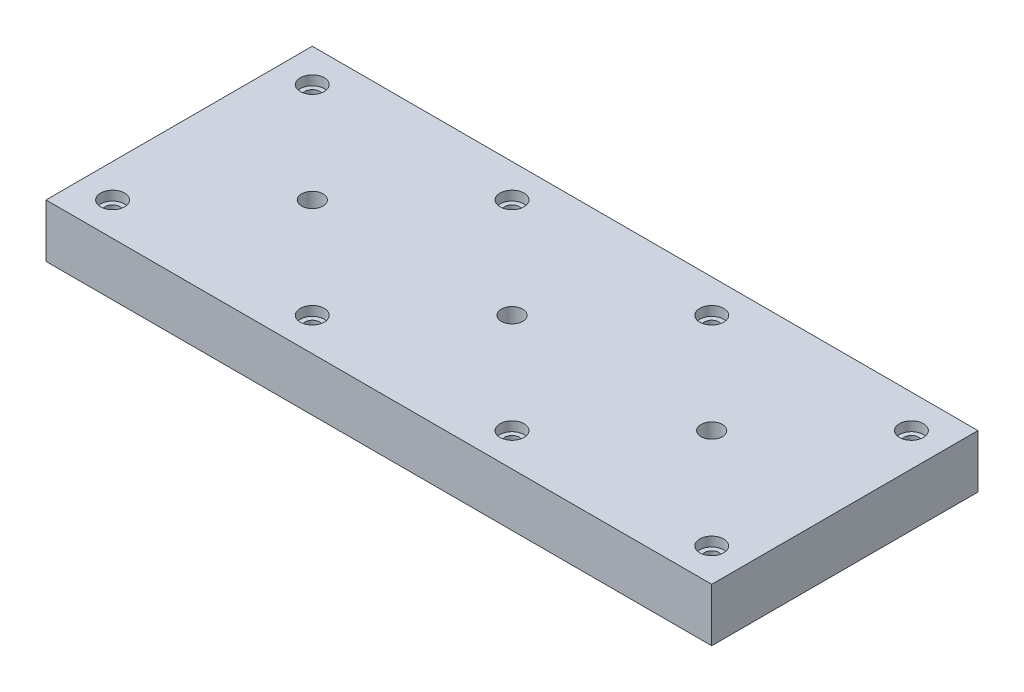
ISO-10303-21;
HEADER;
FILE_DESCRIPTION(('STEP AP214'),'2;1');
FILE_NAME('part.step','',(''),(''),'','','');
FILE_SCHEMA(('AUTOMOTIVE_DESIGN { 1 0 10303 214 1 1 1 1 }'));
ENDSEC;
DATA;
#1=APPLICATION_CONTEXT('core data for automotive mechanical design processes');
#2=APPLICATION_PROTOCOL_DEFINITION('international standard','automotive_design',2000,#1);
#3=PRODUCT_CONTEXT('',#1,'mechanical');
#4=PRODUCT('Part','Part','',(#3));
#5=PRODUCT_RELATED_PRODUCT_CATEGORY('part','',(#4));
#6=PRODUCT_DEFINITION_FORMATION('','',#4);
#7=PRODUCT_DEFINITION_CONTEXT('part definition',#1,'design');
#8=PRODUCT_DEFINITION('design','',#6,#7);
#9=PRODUCT_DEFINITION_SHAPE('','',#8);
#10=(LENGTH_UNIT() NAMED_UNIT(*) SI_UNIT(.MILLI.,.METRE.));
#11=(NAMED_UNIT(*) PLANE_ANGLE_UNIT() SI_UNIT($,.RADIAN.));
#12=(NAMED_UNIT(*) SI_UNIT($,.STERADIAN.) SOLID_ANGLE_UNIT());
#13=UNCERTAINTY_MEASURE_WITH_UNIT(LENGTH_MEASURE(1.E-05),#10,'distance_accuracy_value','');
#14=(GEOMETRIC_REPRESENTATION_CONTEXT(3) GLOBAL_UNCERTAINTY_ASSIGNED_CONTEXT((#13)) GLOBAL_UNIT_ASSIGNED_CONTEXT((#10,
#11,#12)) REPRESENTATION_CONTEXT('',''));
#15=CARTESIAN_POINT('',(0.,0.,0.));
#16=DIRECTION('',(0.,0.,1.));
#17=DIRECTION('',(1.,0.,0.));
#18=AXIS2_PLACEMENT_3D('',#15,#16,#17);
#19=CARTESIAN_POINT('',(0.,40.,0.));
#20=DIRECTION('',(0.,-1.,0.));
#21=DIRECTION('',(0.,0.,-1.));
#22=AXIS2_PLACEMENT_3D('',#19,#20,#21);
#23=PLANE('',#22);
#24=CARTESIAN_POINT('',(150.,40.,0.));
#25=DIRECTION('',(0.,1.,0.));
#26=DIRECTION('',(0.,0.,1.));
#27=AXIS2_PLACEMENT_3D('',#24,#25,#26);
#28=CIRCLE('',#27,8.00000000000001);
#29=CARTESIAN_POINT('',(150.,40.,8.00000000000001));
#30=VERTEX_POINT('',#29);
#31=EDGE_CURVE('E213',#30,#30,#28,.T.);
#32=ORIENTED_EDGE('',*,*,#31,.F.);
#33=EDGE_LOOP('',(#32));
#34=FACE_BOUND('',#33,.T.);
#35=CARTESIAN_POINT('',(-225.,40.,-75.));
#36=DIRECTION('',(0.,1.,0.));
#37=DIRECTION('',(0.,0.,1.));
#38=AXIS2_PLACEMENT_3D('',#35,#36,#37);
#39=CIRCLE('',#38,9.00000000000001);
#40=CARTESIAN_POINT('',(-225.,40.,-66.));
#41=VERTEX_POINT('',#40);
#42=EDGE_CURVE('E207',#41,#41,#39,.T.);
#43=ORIENTED_EDGE('',*,*,#42,.F.);
#44=EDGE_LOOP('',(#43));
#45=FACE_BOUND('',#44,.T.);
#46=CARTESIAN_POINT('',(-74.9999999999998,40.,-75.));
#47=DIRECTION('',(0.,1.,0.));
#48=DIRECTION('',(0.,0.,1.));
#49=AXIS2_PLACEMENT_3D('',#46,#47,#48);
#50=CIRCLE('',#49,8.99999999999999);
#51=CARTESIAN_POINT('',(-74.9999999999998,40.,-66.));
#52=VERTEX_POINT('',#51);
#53=EDGE_CURVE('E195',#52,#52,#50,.T.);
#54=ORIENTED_EDGE('',*,*,#53,.F.);
#55=EDGE_LOOP('',(#54));
#56=FACE_BOUND('',#55,.T.);
#57=CARTESIAN_POINT('',(75.0000000000002,40.,-75.));
#58=DIRECTION('',(0.,1.,0.));
#59=DIRECTION('',(0.,0.,1.));
#60=AXIS2_PLACEMENT_3D('',#57,#58,#59);
#61=CIRCLE('',#60,8.99999999999999);
#62=CARTESIAN_POINT('',(75.0000000000002,40.,-66.));
#63=VERTEX_POINT('',#62);
#64=EDGE_CURVE('E183',#63,#63,#61,.T.);
#65=ORIENTED_EDGE('',*,*,#64,.F.);
#66=EDGE_LOOP('',(#65));
#67=FACE_BOUND('',#66,.T.);
#68=CARTESIAN_POINT('',(-74.9999999999961,40.,75.));
#69=DIRECTION('',(0.,1.,0.));
#70=DIRECTION('',(0.,0.,1.));
#71=AXIS2_PLACEMENT_3D('',#68,#69,#70);
#72=CIRCLE('',#71,8.99999999999999);
#73=CARTESIAN_POINT('',(-74.9999999999961,40.,84.));
#74=VERTEX_POINT('',#73);
#75=EDGE_CURVE('E171',#74,#74,#72,.T.);
#76=ORIENTED_EDGE('',*,*,#75,.F.);
#77=EDGE_LOOP('',(#76));
#78=FACE_BOUND('',#77,.T.);
#79=CARTESIAN_POINT('',(75.000000000004,40.,75.));
#80=DIRECTION('',(0.,1.,0.));
#81=DIRECTION('',(0.,0.,1.));
#82=AXIS2_PLACEMENT_3D('',#79,#80,#81);
#83=CIRCLE('',#82,8.99999999999999);
#84=CARTESIAN_POINT('',(75.000000000004,40.,84.));
#85=VERTEX_POINT('',#84);
#86=EDGE_CURVE('E159',#85,#85,#83,.T.);
#87=ORIENTED_EDGE('',*,*,#86,.F.);
#88=EDGE_LOOP('',(#87));
#89=FACE_BOUND('',#88,.T.);
#90=CARTESIAN_POINT('',(-224.999999999998,40.,75.));
#91=DIRECTION('',(0.,1.,0.));
#92=DIRECTION('',(0.,0.,1.));
#93=AXIS2_PLACEMENT_3D('',#90,#91,#92);
#94=CIRCLE('',#93,9.00000000000001);
#95=CARTESIAN_POINT('',(-224.999999999998,40.,84.));
#96=VERTEX_POINT('',#95);
#97=EDGE_CURVE('E147',#96,#96,#94,.T.);
#98=ORIENTED_EDGE('',*,*,#97,.F.);
#99=EDGE_LOOP('',(#98));
#100=FACE_BOUND('',#99,.T.);
#101=CARTESIAN_POINT('',(225.,40.,-75.));
#102=DIRECTION('',(0.,1.,0.));
#103=DIRECTION('',(0.,0.,1.));
#104=AXIS2_PLACEMENT_3D('',#101,#102,#103);
#105=CIRCLE('',#104,9.00000000000001);
#106=CARTESIAN_POINT('',(225.,40.,-66.));
#107=VERTEX_POINT('',#106);
#108=EDGE_CURVE('E135',#107,#107,#105,.T.);
#109=ORIENTED_EDGE('',*,*,#108,.F.);
#110=EDGE_LOOP('',(#109));
#111=FACE_BOUND('',#110,.T.);
#112=CARTESIAN_POINT('',(225.000000000004,40.,75.));
#113=DIRECTION('',(0.,1.,0.));
#114=DIRECTION('',(0.,0.,1.));
#115=AXIS2_PLACEMENT_3D('',#112,#113,#114);
#116=CIRCLE('',#115,9.00000000000001);
#117=CARTESIAN_POINT('',(225.000000000004,40.,84.));
#118=VERTEX_POINT('',#117);
#119=EDGE_CURVE('E123',#118,#118,#116,.T.);
#120=ORIENTED_EDGE('',*,*,#119,.F.);
#121=EDGE_LOOP('',(#120));
#122=FACE_BOUND('',#121,.T.);
#123=DIRECTION('',(0.,0.,-1.));
#124=VECTOR('',#123,1.);
#125=CARTESIAN_POINT('',(250.,40.,100.));
#126=LINE('',#125,#124);
#127=CARTESIAN_POINT('',(250.,40.,100.));
#128=VERTEX_POINT('',#127);
#129=CARTESIAN_POINT('',(250.,40.,-100.));
#130=VERTEX_POINT('',#129);
#131=EDGE_CURVE('E89',#128,#130,#126,.T.);
#132=ORIENTED_EDGE('',*,*,#131,.T.);
#133=DIRECTION('',(-1.,0.,0.));
#134=VECTOR('',#133,1.);
#135=CARTESIAN_POINT('',(-250.,40.,-100.));
#136=LINE('',#135,#134);
#137=CARTESIAN_POINT('',(-250.,40.,-100.));
#138=VERTEX_POINT('',#137);
#139=EDGE_CURVE('E84',#130,#138,#136,.T.);
#140=ORIENTED_EDGE('',*,*,#139,.T.);
#141=DIRECTION('',(0.,0.,1.));
#142=VECTOR('',#141,1.);
#143=CARTESIAN_POINT('',(-250.,40.,100.));
#144=LINE('',#143,#142);
#145=CARTESIAN_POINT('',(-250.,40.,100.));
#146=VERTEX_POINT('',#145);
#147=EDGE_CURVE('E87',#138,#146,#144,.T.);
#148=ORIENTED_EDGE('',*,*,#147,.T.);
#149=DIRECTION('',(1.,0.,0.));
#150=VECTOR('',#149,1.);
#151=CARTESIAN_POINT('',(-250.,40.,100.));
#152=LINE('',#151,#150);
#153=EDGE_CURVE('E54',#146,#128,#152,.T.);
#154=ORIENTED_EDGE('',*,*,#153,.T.);
#155=EDGE_LOOP('',(#132,#140,#148,#154));
#156=FACE_BOUND('',#155,.T.);
#157=CARTESIAN_POINT('',(2.22044604925031E-13,40.,0.));
#158=DIRECTION('',(0.,1.,0.));
#159=DIRECTION('',(0.,0.,1.));
#160=AXIS2_PLACEMENT_3D('',#157,#158,#159);
#161=CIRCLE('',#160,7.99999999999999);
#162=CARTESIAN_POINT('',(2.22044604925031E-13,40.,7.99999999999999));
#163=VERTEX_POINT('',#162);
#164=EDGE_CURVE('E219',#163,#163,#161,.T.);
#165=ORIENTED_EDGE('',*,*,#164,.F.);
#166=EDGE_LOOP('',(#165));
#167=FACE_BOUND('',#166,.T.);
#168=CARTESIAN_POINT('',(-150.,40.,0.));
#169=DIRECTION('',(0.,1.,0.));
#170=DIRECTION('',(0.,0.,1.));
#171=AXIS2_PLACEMENT_3D('',#168,#169,#170);
#172=CIRCLE('',#171,8.00000000000001);
#173=CARTESIAN_POINT('',(-150.,40.,8.00000000000001));
#174=VERTEX_POINT('',#173);
#175=EDGE_CURVE('E225',#174,#174,#172,.T.);
#176=ORIENTED_EDGE('',*,*,#175,.F.);
#177=EDGE_LOOP('',(#176));
#178=FACE_BOUND('',#177,.T.);
#179=ADVANCED_FACE('F37',(#34,#45,#56,#67,#78,#89,#100,#111,#122,#156,#167,#178),#23,.F.);
#180=CARTESIAN_POINT('',(250.,40.,100.));
#181=DIRECTION('',(-1.,0.,0.));
#182=DIRECTION('',(0.,0.,1.));
#183=AXIS2_PLACEMENT_3D('',#180,#181,#182);
#184=PLANE('',#183);
#185=DIRECTION('',(0.,0.,-1.));
#186=VECTOR('',#185,1.);
#187=CARTESIAN_POINT('',(250.,0.,100.));
#188=LINE('',#187,#186);
#189=CARTESIAN_POINT('',(250.,0.,100.));
#190=VERTEX_POINT('',#189);
#191=CARTESIAN_POINT('',(250.,0.,-100.));
#192=VERTEX_POINT('',#191);
#193=EDGE_CURVE('E101',#190,#192,#188,.T.);
#194=ORIENTED_EDGE('',*,*,#193,.T.);
#195=DIRECTION('',(0.,-1.,0.));
#196=VECTOR('',#195,1.);
#197=CARTESIAN_POINT('',(250.,40.,-100.));
#198=LINE('',#197,#196);
#199=EDGE_CURVE('E11',#130,#192,#198,.T.);
#200=ORIENTED_EDGE('',*,*,#199,.F.);
#201=ORIENTED_EDGE('',*,*,#131,.F.);
#202=DIRECTION('',(0.,-1.,0.));
#203=VECTOR('',#202,1.);
#204=CARTESIAN_POINT('',(250.,40.,100.));
#205=LINE('',#204,#203);
#206=EDGE_CURVE('E97',#128,#190,#205,.T.);
#207=ORIENTED_EDGE('',*,*,#206,.T.);
#208=EDGE_LOOP('',(#194,#200,#201,#207));
#209=FACE_BOUND('',#208,.T.);
#210=ADVANCED_FACE('F39',(#209),#184,.F.);
#211=CARTESIAN_POINT('',(-250.,40.,-100.));
#212=DIRECTION('',(0.,0.,1.));
#213=DIRECTION('',(1.,0.,0.));
#214=AXIS2_PLACEMENT_3D('',#211,#212,#213);
#215=PLANE('',#214);
#216=DIRECTION('',(-1.,0.,0.));
#217=VECTOR('',#216,1.);
#218=CARTESIAN_POINT('',(-250.,0.,-100.));
#219=LINE('',#218,#217);
#220=CARTESIAN_POINT('',(-250.,0.,-100.));
#221=VERTEX_POINT('',#220);
#222=EDGE_CURVE('E93',#192,#221,#219,.T.);
#223=ORIENTED_EDGE('',*,*,#222,.T.);
#224=DIRECTION('',(0.,-1.,0.));
#225=VECTOR('',#224,1.);
#226=CARTESIAN_POINT('',(-250.,40.,-100.));
#227=LINE('',#226,#225);
#228=EDGE_CURVE('E46',#138,#221,#227,.T.);
#229=ORIENTED_EDGE('',*,*,#228,.F.);
#230=ORIENTED_EDGE('',*,*,#139,.F.);
#231=ORIENTED_EDGE('',*,*,#199,.T.);
#232=EDGE_LOOP('',(#223,#229,#230,#231));
#233=FACE_BOUND('',#232,.T.);
#234=ADVANCED_FACE('F92',(#233),#215,.F.);
#235=CARTESIAN_POINT('',(-250.,40.,100.));
#236=DIRECTION('',(1.,0.,0.));
#237=DIRECTION('',(0.,0.,-1.));
#238=AXIS2_PLACEMENT_3D('',#235,#236,#237);
#239=PLANE('',#238);
#240=DIRECTION('',(0.,0.,1.));
#241=VECTOR('',#240,1.);
#242=CARTESIAN_POINT('',(-250.,0.,100.));
#243=LINE('',#242,#241);
#244=CARTESIAN_POINT('',(-250.,0.,100.));
#245=VERTEX_POINT('',#244);
#246=EDGE_CURVE('E71',#221,#245,#243,.T.);
#247=ORIENTED_EDGE('',*,*,#246,.T.);
#248=DIRECTION('',(0.,-1.,0.));
#249=VECTOR('',#248,1.);
#250=CARTESIAN_POINT('',(-250.,40.,100.));
#251=LINE('',#250,#249);
#252=EDGE_CURVE('E94',#146,#245,#251,.T.);
#253=ORIENTED_EDGE('',*,*,#252,.F.);
#254=ORIENTED_EDGE('',*,*,#147,.F.);
#255=ORIENTED_EDGE('',*,*,#228,.T.);
#256=EDGE_LOOP('',(#247,#253,#254,#255));
#257=FACE_BOUND('',#256,.T.);
#258=ADVANCED_FACE('F95',(#257),#239,.F.);
#259=CARTESIAN_POINT('',(-250.,40.,100.));
#260=DIRECTION('',(0.,0.,-1.));
#261=DIRECTION('',(-1.,0.,0.));
#262=AXIS2_PLACEMENT_3D('',#259,#260,#261);
#263=PLANE('',#262);
#264=DIRECTION('',(1.,0.,0.));
#265=VECTOR('',#264,1.);
#266=CARTESIAN_POINT('',(-250.,0.,100.));
#267=LINE('',#266,#265);
#268=EDGE_CURVE('E77',#245,#190,#267,.T.);
#269=ORIENTED_EDGE('',*,*,#268,.T.);
#270=ORIENTED_EDGE('',*,*,#206,.F.);
#271=ORIENTED_EDGE('',*,*,#153,.F.);
#272=ORIENTED_EDGE('',*,*,#252,.T.);
#273=EDGE_LOOP('',(#269,#270,#271,#272));
#274=FACE_BOUND('',#273,.T.);
#275=ADVANCED_FACE('F109',(#274),#263,.F.);
#276=CARTESIAN_POINT('',(0.,0.,0.));
#277=DIRECTION('',(0.,-1.,0.));
#278=DIRECTION('',(0.,0.,-1.));
#279=AXIS2_PLACEMENT_3D('',#276,#277,#278);
#280=PLANE('',#279);
#281=CARTESIAN_POINT('',(-150.,0.,0.));
#282=DIRECTION('',(0.,-1.,0.));
#283=DIRECTION('',(0.,0.,-1.));
#284=AXIS2_PLACEMENT_3D('',#281,#282,#283);
#285=CIRCLE('',#284,7.99999999999999);
#286=CARTESIAN_POINT('',(-150.,0.,-7.99999999999999));
#287=VERTEX_POINT('',#286);
#288=EDGE_CURVE('E222',#287,#287,#285,.T.);
#289=ORIENTED_EDGE('',*,*,#288,.F.);
#290=EDGE_LOOP('',(#289));
#291=FACE_BOUND('',#290,.T.);
#292=CARTESIAN_POINT('',(2.22044604925031E-13,0.,0.));
#293=DIRECTION('',(0.,-1.,0.));
#294=DIRECTION('',(0.,0.,-1.));
#295=AXIS2_PLACEMENT_3D('',#292,#293,#294);
#296=CIRCLE('',#295,7.99999999999999);
#297=CARTESIAN_POINT('',(2.22044604925031E-13,0.,-7.99999999999999));
#298=VERTEX_POINT('',#297);
#299=EDGE_CURVE('E216',#298,#298,#296,.T.);
#300=ORIENTED_EDGE('',*,*,#299,.F.);
#301=EDGE_LOOP('',(#300));
#302=FACE_BOUND('',#301,.T.);
#303=CARTESIAN_POINT('',(150.,0.,0.));
#304=DIRECTION('',(0.,-1.,0.));
#305=DIRECTION('',(0.,0.,-1.));
#306=AXIS2_PLACEMENT_3D('',#303,#304,#305);
#307=CIRCLE('',#306,7.99999999999999);
#308=CARTESIAN_POINT('',(150.,0.,-7.99999999999999));
#309=VERTEX_POINT('',#308);
#310=EDGE_CURVE('E210',#309,#309,#307,.T.);
#311=ORIENTED_EDGE('',*,*,#310,.F.);
#312=EDGE_LOOP('',(#311));
#313=FACE_BOUND('',#312,.T.);
#314=CARTESIAN_POINT('',(-225.,0.,-75.));
#315=DIRECTION('',(0.,-1.,0.));
#316=DIRECTION('',(0.,0.,-1.));
#317=AXIS2_PLACEMENT_3D('',#314,#315,#316);
#318=CIRCLE('',#317,5.49999999999999);
#319=CARTESIAN_POINT('',(-225.,0.,-80.5));
#320=VERTEX_POINT('',#319);
#321=EDGE_CURVE('E198',#320,#320,#318,.T.);
#322=ORIENTED_EDGE('',*,*,#321,.F.);
#323=EDGE_LOOP('',(#322));
#324=FACE_BOUND('',#323,.T.);
#325=CARTESIAN_POINT('',(-74.9999999999998,0.,-75.));
#326=DIRECTION('',(0.,-1.,0.));
#327=DIRECTION('',(0.,0.,-1.));
#328=AXIS2_PLACEMENT_3D('',#325,#326,#327);
#329=CIRCLE('',#328,5.5);
#330=CARTESIAN_POINT('',(-74.9999999999998,0.,-80.5));
#331=VERTEX_POINT('',#330);
#332=EDGE_CURVE('E186',#331,#331,#329,.T.);
#333=ORIENTED_EDGE('',*,*,#332,.F.);
#334=EDGE_LOOP('',(#333));
#335=FACE_BOUND('',#334,.T.);
#336=CARTESIAN_POINT('',(75.0000000000002,0.,-75.));
#337=DIRECTION('',(0.,-1.,0.));
#338=DIRECTION('',(0.,0.,-1.));
#339=AXIS2_PLACEMENT_3D('',#336,#337,#338);
#340=CIRCLE('',#339,5.5);
#341=CARTESIAN_POINT('',(75.0000000000002,0.,-80.5));
#342=VERTEX_POINT('',#341);
#343=EDGE_CURVE('E174',#342,#342,#340,.T.);
#344=ORIENTED_EDGE('',*,*,#343,.F.);
#345=EDGE_LOOP('',(#344));
#346=FACE_BOUND('',#345,.T.);
#347=CARTESIAN_POINT('',(-74.9999999999961,0.,75.));
#348=DIRECTION('',(0.,-1.,0.));
#349=DIRECTION('',(0.,0.,-1.));
#350=AXIS2_PLACEMENT_3D('',#347,#348,#349);
#351=CIRCLE('',#350,5.5);
#352=CARTESIAN_POINT('',(-74.9999999999961,0.,69.5));
#353=VERTEX_POINT('',#352);
#354=EDGE_CURVE('E162',#353,#353,#351,.T.);
#355=ORIENTED_EDGE('',*,*,#354,.F.);
#356=EDGE_LOOP('',(#355));
#357=FACE_BOUND('',#356,.T.);
#358=CARTESIAN_POINT('',(75.000000000004,0.,75.));
#359=DIRECTION('',(0.,-1.,0.));
#360=DIRECTION('',(0.,0.,-1.));
#361=AXIS2_PLACEMENT_3D('',#358,#359,#360);
#362=CIRCLE('',#361,5.5);
#363=CARTESIAN_POINT('',(75.000000000004,0.,69.5));
#364=VERTEX_POINT('',#363);
#365=EDGE_CURVE('E150',#364,#364,#362,.T.);
#366=ORIENTED_EDGE('',*,*,#365,.F.);
#367=EDGE_LOOP('',(#366));
#368=FACE_BOUND('',#367,.T.);
#369=CARTESIAN_POINT('',(-224.999999999998,0.,75.));
#370=DIRECTION('',(0.,-1.,0.));
#371=DIRECTION('',(0.,0.,-1.));
#372=AXIS2_PLACEMENT_3D('',#369,#370,#371);
#373=CIRCLE('',#372,5.49999999999999);
#374=CARTESIAN_POINT('',(-224.999999999998,0.,69.5));
#375=VERTEX_POINT('',#374);
#376=EDGE_CURVE('E138',#375,#375,#373,.T.);
#377=ORIENTED_EDGE('',*,*,#376,.F.);
#378=EDGE_LOOP('',(#377));
#379=FACE_BOUND('',#378,.T.);
#380=CARTESIAN_POINT('',(225.,0.,-75.));
#381=DIRECTION('',(0.,-1.,0.));
#382=DIRECTION('',(0.,0.,-1.));
#383=AXIS2_PLACEMENT_3D('',#380,#381,#382);
#384=CIRCLE('',#383,5.49999999999999);
#385=CARTESIAN_POINT('',(225.,0.,-80.5));
#386=VERTEX_POINT('',#385);
#387=EDGE_CURVE('E126',#386,#386,#384,.T.);
#388=ORIENTED_EDGE('',*,*,#387,.F.);
#389=EDGE_LOOP('',(#388));
#390=FACE_BOUND('',#389,.T.);
#391=CARTESIAN_POINT('',(225.000000000004,0.,75.));
#392=DIRECTION('',(0.,-1.,0.));
#393=DIRECTION('',(0.,0.,-1.));
#394=AXIS2_PLACEMENT_3D('',#391,#392,#393);
#395=CIRCLE('',#394,5.49999999999999);
#396=CARTESIAN_POINT('',(225.000000000004,0.,69.5));
#397=VERTEX_POINT('',#396);
#398=EDGE_CURVE('E104',#397,#397,#395,.T.);
#399=ORIENTED_EDGE('',*,*,#398,.F.);
#400=EDGE_LOOP('',(#399));
#401=FACE_BOUND('',#400,.T.);
#402=ORIENTED_EDGE('',*,*,#193,.F.);
#403=ORIENTED_EDGE('',*,*,#268,.F.);
#404=ORIENTED_EDGE('',*,*,#246,.F.);
#405=ORIENTED_EDGE('',*,*,#222,.F.);
#406=EDGE_LOOP('',(#402,#403,#404,#405));
#407=FACE_BOUND('',#406,.T.);
#408=ADVANCED_FACE('F112',(#291,#302,#313,#324,#335,#346,#357,#368,#379,#390,#401,#407),#280,.T.);
#409=CARTESIAN_POINT('',(225.000000000004,40.,75.));
#410=DIRECTION('',(0.,1.,0.));
#411=DIRECTION('',(0.,0.,1.));
#412=AXIS2_PLACEMENT_3D('',#409,#410,#411);
#413=CYLINDRICAL_SURFACE('',#412,5.49999999999999);
#414=CARTESIAN_POINT('',(225.000000000004,32.9,75.));
#415=DIRECTION('',(0.,1.,0.));
#416=DIRECTION('',(0.,0.,1.));
#417=AXIS2_PLACEMENT_3D('',#414,#415,#416);
#418=CIRCLE('',#417,5.50000000000001);
#419=CARTESIAN_POINT('',(225.000000000004,32.9,80.5));
#420=VERTEX_POINT('',#419);
#421=EDGE_CURVE('E117',#420,#420,#418,.T.);
#422=ORIENTED_EDGE('',*,*,#421,.T.);
#423=EDGE_LOOP('',(#422));
#424=FACE_BOUND('',#423,.T.);
#425=ORIENTED_EDGE('',*,*,#398,.T.);
#426=EDGE_LOOP('',(#425));
#427=FACE_BOUND('',#426,.T.);
#428=ADVANCED_FACE('F242',(#424,#427),#413,.F.);
#429=CARTESIAN_POINT('',(230.500000000004,32.9,75.));
#430=DIRECTION('',(0.,-1.,0.));
#431=DIRECTION('',(0.,0.,-1.));
#432=AXIS2_PLACEMENT_3D('',#429,#430,#431);
#433=PLANE('',#432);
#434=ORIENTED_EDGE('',*,*,#421,.F.);
#435=EDGE_LOOP('',(#434));
#436=FACE_BOUND('',#435,.T.);
#437=CARTESIAN_POINT('',(225.000000000004,32.9,75.));
#438=DIRECTION('',(0.,1.,0.));
#439=DIRECTION('',(0.,0.,1.));
#440=AXIS2_PLACEMENT_3D('',#437,#438,#439);
#441=CIRCLE('',#440,9.00000000000001);
#442=CARTESIAN_POINT('',(225.000000000004,32.9,84.));
#443=VERTEX_POINT('',#442);
#444=EDGE_CURVE('E120',#443,#443,#441,.T.);
#445=ORIENTED_EDGE('',*,*,#444,.T.);
#446=EDGE_LOOP('',(#445));
#447=FACE_BOUND('',#446,.T.);
#448=ADVANCED_FACE('F274',(#436,#447),#433,.F.);
#449=CARTESIAN_POINT('',(225.000000000004,40.,75.));
#450=DIRECTION('',(0.,1.,0.));
#451=DIRECTION('',(0.,0.,1.));
#452=AXIS2_PLACEMENT_3D('',#449,#450,#451);
#453=CYLINDRICAL_SURFACE('',#452,9.00000000000001);
#454=ORIENTED_EDGE('',*,*,#444,.F.);
#455=EDGE_LOOP('',(#454));
#456=FACE_BOUND('',#455,.T.);
#457=ORIENTED_EDGE('',*,*,#119,.T.);
#458=EDGE_LOOP('',(#457));
#459=FACE_BOUND('',#458,.T.);
#460=ADVANCED_FACE('F281',(#456,#459),#453,.F.);
#461=CARTESIAN_POINT('',(225.,40.,-75.));
#462=DIRECTION('',(0.,1.,0.));
#463=DIRECTION('',(0.,0.,1.));
#464=AXIS2_PLACEMENT_3D('',#461,#462,#463);
#465=CYLINDRICAL_SURFACE('',#464,5.49999999999999);
#466=CARTESIAN_POINT('',(225.,32.9,-75.));
#467=DIRECTION('',(0.,1.,0.));
#468=DIRECTION('',(0.,0.,1.));
#469=AXIS2_PLACEMENT_3D('',#466,#467,#468);
#470=CIRCLE('',#469,5.50000000000001);
#471=CARTESIAN_POINT('',(225.,32.9,-69.5));
#472=VERTEX_POINT('',#471);
#473=EDGE_CURVE('E129',#472,#472,#470,.T.);
#474=ORIENTED_EDGE('',*,*,#473,.T.);
#475=EDGE_LOOP('',(#474));
#476=FACE_BOUND('',#475,.T.);
#477=ORIENTED_EDGE('',*,*,#387,.T.);
#478=EDGE_LOOP('',(#477));
#479=FACE_BOUND('',#478,.T.);
#480=ADVANCED_FACE('F288',(#476,#479),#465,.F.);
#481=CARTESIAN_POINT('',(230.5,32.9,-75.));
#482=DIRECTION('',(0.,-1.,0.));
#483=DIRECTION('',(0.,0.,-1.));
#484=AXIS2_PLACEMENT_3D('',#481,#482,#483);
#485=PLANE('',#484);
#486=ORIENTED_EDGE('',*,*,#473,.F.);
#487=EDGE_LOOP('',(#486));
#488=FACE_BOUND('',#487,.T.);
#489=CARTESIAN_POINT('',(225.,32.9,-75.));
#490=DIRECTION('',(0.,1.,0.));
#491=DIRECTION('',(0.,0.,1.));
#492=AXIS2_PLACEMENT_3D('',#489,#490,#491);
#493=CIRCLE('',#492,9.00000000000001);
#494=CARTESIAN_POINT('',(225.,32.9,-66.));
#495=VERTEX_POINT('',#494);
#496=EDGE_CURVE('E132',#495,#495,#493,.T.);
#497=ORIENTED_EDGE('',*,*,#496,.T.);
#498=EDGE_LOOP('',(#497));
#499=FACE_BOUND('',#498,.T.);
#500=ADVANCED_FACE('F296',(#488,#499),#485,.F.);
#501=CARTESIAN_POINT('',(225.,40.,-75.));
#502=DIRECTION('',(0.,1.,0.));
#503=DIRECTION('',(0.,0.,1.));
#504=AXIS2_PLACEMENT_3D('',#501,#502,#503);
#505=CYLINDRICAL_SURFACE('',#504,9.00000000000001);
#506=ORIENTED_EDGE('',*,*,#496,.F.);
#507=EDGE_LOOP('',(#506));
#508=FACE_BOUND('',#507,.T.);
#509=ORIENTED_EDGE('',*,*,#108,.T.);
#510=EDGE_LOOP('',(#509));
#511=FACE_BOUND('',#510,.T.);
#512=ADVANCED_FACE('F304',(#508,#511),#505,.F.);
#513=CARTESIAN_POINT('',(-224.999999999998,40.,75.));
#514=DIRECTION('',(0.,1.,0.));
#515=DIRECTION('',(0.,0.,1.));
#516=AXIS2_PLACEMENT_3D('',#513,#514,#515);
#517=CYLINDRICAL_SURFACE('',#516,5.49999999999999);
#518=CARTESIAN_POINT('',(-224.999999999998,32.9,75.));
#519=DIRECTION('',(0.,1.,0.));
#520=DIRECTION('',(0.,0.,1.));
#521=AXIS2_PLACEMENT_3D('',#518,#519,#520);
#522=CIRCLE('',#521,5.50000000000001);
#523=CARTESIAN_POINT('',(-224.999999999998,32.9,80.5));
#524=VERTEX_POINT('',#523);
#525=EDGE_CURVE('E141',#524,#524,#522,.T.);
#526=ORIENTED_EDGE('',*,*,#525,.T.);
#527=EDGE_LOOP('',(#526));
#528=FACE_BOUND('',#527,.T.);
#529=ORIENTED_EDGE('',*,*,#376,.T.);
#530=EDGE_LOOP('',(#529));
#531=FACE_BOUND('',#530,.T.);
#532=ADVANCED_FACE('F312',(#528,#531),#517,.F.);
#533=CARTESIAN_POINT('',(-219.499999999998,32.9,75.));
#534=DIRECTION('',(0.,-1.,0.));
#535=DIRECTION('',(0.,0.,-1.));
#536=AXIS2_PLACEMENT_3D('',#533,#534,#535);
#537=PLANE('',#536);
#538=ORIENTED_EDGE('',*,*,#525,.F.);
#539=EDGE_LOOP('',(#538));
#540=FACE_BOUND('',#539,.T.);
#541=CARTESIAN_POINT('',(-224.999999999998,32.9,75.));
#542=DIRECTION('',(0.,1.,0.));
#543=DIRECTION('',(0.,0.,1.));
#544=AXIS2_PLACEMENT_3D('',#541,#542,#543);
#545=CIRCLE('',#544,9.00000000000001);
#546=CARTESIAN_POINT('',(-224.999999999998,32.9,84.));
#547=VERTEX_POINT('',#546);
#548=EDGE_CURVE('E144',#547,#547,#545,.T.);
#549=ORIENTED_EDGE('',*,*,#548,.T.);
#550=EDGE_LOOP('',(#549));
#551=FACE_BOUND('',#550,.T.);
#552=ADVANCED_FACE('F320',(#540,#551),#537,.F.);
#553=CARTESIAN_POINT('',(-224.999999999998,40.,75.));
#554=DIRECTION('',(0.,1.,0.));
#555=DIRECTION('',(0.,0.,1.));
#556=AXIS2_PLACEMENT_3D('',#553,#554,#555);
#557=CYLINDRICAL_SURFACE('',#556,9.00000000000001);
#558=ORIENTED_EDGE('',*,*,#548,.F.);
#559=EDGE_LOOP('',(#558));
#560=FACE_BOUND('',#559,.T.);
#561=ORIENTED_EDGE('',*,*,#97,.T.);
#562=EDGE_LOOP('',(#561));
#563=FACE_BOUND('',#562,.T.);
#564=ADVANCED_FACE('F328',(#560,#563),#557,.F.);
#565=CARTESIAN_POINT('',(75.000000000004,40.,75.));
#566=DIRECTION('',(0.,1.,0.));
#567=DIRECTION('',(0.,0.,1.));
#568=AXIS2_PLACEMENT_3D('',#565,#566,#567);
#569=CYLINDRICAL_SURFACE('',#568,5.5);
#570=CARTESIAN_POINT('',(75.000000000004,32.9,75.));
#571=DIRECTION('',(0.,1.,0.));
#572=DIRECTION('',(0.,0.,1.));
#573=AXIS2_PLACEMENT_3D('',#570,#571,#572);
#574=CIRCLE('',#573,5.50000000000001);
#575=CARTESIAN_POINT('',(75.000000000004,32.9,80.5));
#576=VERTEX_POINT('',#575);
#577=EDGE_CURVE('E153',#576,#576,#574,.T.);
#578=ORIENTED_EDGE('',*,*,#577,.T.);
#579=EDGE_LOOP('',(#578));
#580=FACE_BOUND('',#579,.T.);
#581=ORIENTED_EDGE('',*,*,#365,.T.);
#582=EDGE_LOOP('',(#581));
#583=FACE_BOUND('',#582,.T.);
#584=ADVANCED_FACE('F336',(#580,#583),#569,.F.);
#585=CARTESIAN_POINT('',(80.500000000004,32.9,75.));
#586=DIRECTION('',(0.,-1.,0.));
#587=DIRECTION('',(0.,0.,-1.));
#588=AXIS2_PLACEMENT_3D('',#585,#586,#587);
#589=PLANE('',#588);
#590=ORIENTED_EDGE('',*,*,#577,.F.);
#591=EDGE_LOOP('',(#590));
#592=FACE_BOUND('',#591,.T.);
#593=CARTESIAN_POINT('',(75.000000000004,32.9,75.));
#594=DIRECTION('',(0.,1.,0.));
#595=DIRECTION('',(0.,0.,1.));
#596=AXIS2_PLACEMENT_3D('',#593,#594,#595);
#597=CIRCLE('',#596,9.00000000000001);
#598=CARTESIAN_POINT('',(75.000000000004,32.9,84.));
#599=VERTEX_POINT('',#598);
#600=EDGE_CURVE('E156',#599,#599,#597,.T.);
#601=ORIENTED_EDGE('',*,*,#600,.T.);
#602=EDGE_LOOP('',(#601));
#603=FACE_BOUND('',#602,.T.);
#604=ADVANCED_FACE('F344',(#592,#603),#589,.F.);
#605=CARTESIAN_POINT('',(75.000000000004,40.,75.));
#606=DIRECTION('',(0.,1.,0.));
#607=DIRECTION('',(0.,0.,1.));
#608=AXIS2_PLACEMENT_3D('',#605,#606,#607);
#609=CYLINDRICAL_SURFACE('',#608,9.);
#610=ORIENTED_EDGE('',*,*,#600,.F.);
#611=EDGE_LOOP('',(#610));
#612=FACE_BOUND('',#611,.T.);
#613=ORIENTED_EDGE('',*,*,#86,.T.);
#614=EDGE_LOOP('',(#613));
#615=FACE_BOUND('',#614,.T.);
#616=ADVANCED_FACE('F352',(#612,#615),#609,.F.);
#617=CARTESIAN_POINT('',(-74.9999999999961,40.,75.));
#618=DIRECTION('',(0.,1.,0.));
#619=DIRECTION('',(0.,0.,1.));
#620=AXIS2_PLACEMENT_3D('',#617,#618,#619);
#621=CYLINDRICAL_SURFACE('',#620,5.5);
#622=CARTESIAN_POINT('',(-74.9999999999961,32.9,75.));
#623=DIRECTION('',(0.,1.,0.));
#624=DIRECTION('',(0.,0.,1.));
#625=AXIS2_PLACEMENT_3D('',#622,#623,#624);
#626=CIRCLE('',#625,5.50000000000001);
#627=CARTESIAN_POINT('',(-74.9999999999961,32.9,80.5));
#628=VERTEX_POINT('',#627);
#629=EDGE_CURVE('E165',#628,#628,#626,.T.);
#630=ORIENTED_EDGE('',*,*,#629,.T.);
#631=EDGE_LOOP('',(#630));
#632=FACE_BOUND('',#631,.T.);
#633=ORIENTED_EDGE('',*,*,#354,.T.);
#634=EDGE_LOOP('',(#633));
#635=FACE_BOUND('',#634,.T.);
#636=ADVANCED_FACE('F360',(#632,#635),#621,.F.);
#637=CARTESIAN_POINT('',(-69.4999999999961,32.9,75.));
#638=DIRECTION('',(0.,-1.,0.));
#639=DIRECTION('',(0.,0.,-1.));
#640=AXIS2_PLACEMENT_3D('',#637,#638,#639);
#641=PLANE('',#640);
#642=ORIENTED_EDGE('',*,*,#629,.F.);
#643=EDGE_LOOP('',(#642));
#644=FACE_BOUND('',#643,.T.);
#645=CARTESIAN_POINT('',(-74.9999999999961,32.9,75.));
#646=DIRECTION('',(0.,1.,0.));
#647=DIRECTION('',(0.,0.,1.));
#648=AXIS2_PLACEMENT_3D('',#645,#646,#647);
#649=CIRCLE('',#648,9.00000000000001);
#650=CARTESIAN_POINT('',(-74.9999999999961,32.9,84.));
#651=VERTEX_POINT('',#650);
#652=EDGE_CURVE('E168',#651,#651,#649,.T.);
#653=ORIENTED_EDGE('',*,*,#652,.T.);
#654=EDGE_LOOP('',(#653));
#655=FACE_BOUND('',#654,.T.);
#656=ADVANCED_FACE('F368',(#644,#655),#641,.F.);
#657=CARTESIAN_POINT('',(-74.9999999999961,40.,75.));
#658=DIRECTION('',(0.,1.,0.));
#659=DIRECTION('',(0.,0.,1.));
#660=AXIS2_PLACEMENT_3D('',#657,#658,#659);
#661=CYLINDRICAL_SURFACE('',#660,9.);
#662=ORIENTED_EDGE('',*,*,#652,.F.);
#663=EDGE_LOOP('',(#662));
#664=FACE_BOUND('',#663,.T.);
#665=ORIENTED_EDGE('',*,*,#75,.T.);
#666=EDGE_LOOP('',(#665));
#667=FACE_BOUND('',#666,.T.);
#668=ADVANCED_FACE('F376',(#664,#667),#661,.F.);
#669=CARTESIAN_POINT('',(75.0000000000002,40.,-75.));
#670=DIRECTION('',(0.,1.,0.));
#671=DIRECTION('',(0.,0.,1.));
#672=AXIS2_PLACEMENT_3D('',#669,#670,#671);
#673=CYLINDRICAL_SURFACE('',#672,5.5);
#674=CARTESIAN_POINT('',(75.0000000000002,32.9,-75.));
#675=DIRECTION('',(0.,1.,0.));
#676=DIRECTION('',(0.,0.,1.));
#677=AXIS2_PLACEMENT_3D('',#674,#675,#676);
#678=CIRCLE('',#677,5.50000000000001);
#679=CARTESIAN_POINT('',(75.0000000000002,32.9,-69.5));
#680=VERTEX_POINT('',#679);
#681=EDGE_CURVE('E177',#680,#680,#678,.T.);
#682=ORIENTED_EDGE('',*,*,#681,.T.);
#683=EDGE_LOOP('',(#682));
#684=FACE_BOUND('',#683,.T.);
#685=ORIENTED_EDGE('',*,*,#343,.T.);
#686=EDGE_LOOP('',(#685));
#687=FACE_BOUND('',#686,.T.);
#688=ADVANCED_FACE('F384',(#684,#687),#673,.F.);
#689=CARTESIAN_POINT('',(80.5000000000002,32.9,-75.));
#690=DIRECTION('',(0.,-1.,0.));
#691=DIRECTION('',(0.,0.,-1.));
#692=AXIS2_PLACEMENT_3D('',#689,#690,#691);
#693=PLANE('',#692);
#694=ORIENTED_EDGE('',*,*,#681,.F.);
#695=EDGE_LOOP('',(#694));
#696=FACE_BOUND('',#695,.T.);
#697=CARTESIAN_POINT('',(75.0000000000002,32.9,-75.));
#698=DIRECTION('',(0.,1.,0.));
#699=DIRECTION('',(0.,0.,1.));
#700=AXIS2_PLACEMENT_3D('',#697,#698,#699);
#701=CIRCLE('',#700,9.00000000000001);
#702=CARTESIAN_POINT('',(75.0000000000002,32.9,-66.));
#703=VERTEX_POINT('',#702);
#704=EDGE_CURVE('E180',#703,#703,#701,.T.);
#705=ORIENTED_EDGE('',*,*,#704,.T.);
#706=EDGE_LOOP('',(#705));
#707=FACE_BOUND('',#706,.T.);
#708=ADVANCED_FACE('F392',(#696,#707),#693,.F.);
#709=CARTESIAN_POINT('',(75.0000000000002,40.,-75.));
#710=DIRECTION('',(0.,1.,0.));
#711=DIRECTION('',(0.,0.,1.));
#712=AXIS2_PLACEMENT_3D('',#709,#710,#711);
#713=CYLINDRICAL_SURFACE('',#712,9.);
#714=ORIENTED_EDGE('',*,*,#704,.F.);
#715=EDGE_LOOP('',(#714));
#716=FACE_BOUND('',#715,.T.);
#717=ORIENTED_EDGE('',*,*,#64,.T.);
#718=EDGE_LOOP('',(#717));
#719=FACE_BOUND('',#718,.T.);
#720=ADVANCED_FACE('F400',(#716,#719),#713,.F.);
#721=CARTESIAN_POINT('',(-74.9999999999998,40.,-75.));
#722=DIRECTION('',(0.,1.,0.));
#723=DIRECTION('',(0.,0.,1.));
#724=AXIS2_PLACEMENT_3D('',#721,#722,#723);
#725=CYLINDRICAL_SURFACE('',#724,5.5);
#726=CARTESIAN_POINT('',(-74.9999999999998,32.9,-75.));
#727=DIRECTION('',(0.,1.,0.));
#728=DIRECTION('',(0.,0.,1.));
#729=AXIS2_PLACEMENT_3D('',#726,#727,#728);
#730=CIRCLE('',#729,5.50000000000001);
#731=CARTESIAN_POINT('',(-74.9999999999998,32.9,-69.5));
#732=VERTEX_POINT('',#731);
#733=EDGE_CURVE('E189',#732,#732,#730,.T.);
#734=ORIENTED_EDGE('',*,*,#733,.T.);
#735=EDGE_LOOP('',(#734));
#736=FACE_BOUND('',#735,.T.);
#737=ORIENTED_EDGE('',*,*,#332,.T.);
#738=EDGE_LOOP('',(#737));
#739=FACE_BOUND('',#738,.T.);
#740=ADVANCED_FACE('F408',(#736,#739),#725,.F.);
#741=CARTESIAN_POINT('',(-69.4999999999998,32.9,-75.));
#742=DIRECTION('',(0.,-1.,0.));
#743=DIRECTION('',(0.,0.,-1.));
#744=AXIS2_PLACEMENT_3D('',#741,#742,#743);
#745=PLANE('',#744);
#746=ORIENTED_EDGE('',*,*,#733,.F.);
#747=EDGE_LOOP('',(#746));
#748=FACE_BOUND('',#747,.T.);
#749=CARTESIAN_POINT('',(-74.9999999999998,32.9,-75.));
#750=DIRECTION('',(0.,1.,0.));
#751=DIRECTION('',(0.,0.,1.));
#752=AXIS2_PLACEMENT_3D('',#749,#750,#751);
#753=CIRCLE('',#752,9.00000000000001);
#754=CARTESIAN_POINT('',(-74.9999999999998,32.9,-66.));
#755=VERTEX_POINT('',#754);
#756=EDGE_CURVE('E192',#755,#755,#753,.T.);
#757=ORIENTED_EDGE('',*,*,#756,.T.);
#758=EDGE_LOOP('',(#757));
#759=FACE_BOUND('',#758,.T.);
#760=ADVANCED_FACE('F416',(#748,#759),#745,.F.);
#761=CARTESIAN_POINT('',(-74.9999999999998,40.,-75.));
#762=DIRECTION('',(0.,1.,0.));
#763=DIRECTION('',(0.,0.,1.));
#764=AXIS2_PLACEMENT_3D('',#761,#762,#763);
#765=CYLINDRICAL_SURFACE('',#764,9.);
#766=ORIENTED_EDGE('',*,*,#756,.F.);
#767=EDGE_LOOP('',(#766));
#768=FACE_BOUND('',#767,.T.);
#769=ORIENTED_EDGE('',*,*,#53,.T.);
#770=EDGE_LOOP('',(#769));
#771=FACE_BOUND('',#770,.T.);
#772=ADVANCED_FACE('F424',(#768,#771),#765,.F.);
#773=CARTESIAN_POINT('',(-225.,40.,-75.));
#774=DIRECTION('',(0.,1.,0.));
#775=DIRECTION('',(0.,0.,1.));
#776=AXIS2_PLACEMENT_3D('',#773,#774,#775);
#777=CYLINDRICAL_SURFACE('',#776,5.49999999999999);
#778=CARTESIAN_POINT('',(-225.,32.9,-75.));
#779=DIRECTION('',(0.,1.,0.));
#780=DIRECTION('',(0.,0.,1.));
#781=AXIS2_PLACEMENT_3D('',#778,#779,#780);
#782=CIRCLE('',#781,5.50000000000001);
#783=CARTESIAN_POINT('',(-225.,32.9,-69.5));
#784=VERTEX_POINT('',#783);
#785=EDGE_CURVE('E201',#784,#784,#782,.T.);
#786=ORIENTED_EDGE('',*,*,#785,.T.);
#787=EDGE_LOOP('',(#786));
#788=FACE_BOUND('',#787,.T.);
#789=ORIENTED_EDGE('',*,*,#321,.T.);
#790=EDGE_LOOP('',(#789));
#791=FACE_BOUND('',#790,.T.);
#792=ADVANCED_FACE('F432',(#788,#791),#777,.F.);
#793=CARTESIAN_POINT('',(-219.5,32.9,-75.));
#794=DIRECTION('',(0.,-1.,0.));
#795=DIRECTION('',(0.,0.,-1.));
#796=AXIS2_PLACEMENT_3D('',#793,#794,#795);
#797=PLANE('',#796);
#798=ORIENTED_EDGE('',*,*,#785,.F.);
#799=EDGE_LOOP('',(#798));
#800=FACE_BOUND('',#799,.T.);
#801=CARTESIAN_POINT('',(-225.,32.9,-75.));
#802=DIRECTION('',(0.,1.,0.));
#803=DIRECTION('',(0.,0.,1.));
#804=AXIS2_PLACEMENT_3D('',#801,#802,#803);
#805=CIRCLE('',#804,9.00000000000001);
#806=CARTESIAN_POINT('',(-225.,32.9,-66.));
#807=VERTEX_POINT('',#806);
#808=EDGE_CURVE('E204',#807,#807,#805,.T.);
#809=ORIENTED_EDGE('',*,*,#808,.T.);
#810=EDGE_LOOP('',(#809));
#811=FACE_BOUND('',#810,.T.);
#812=ADVANCED_FACE('F440',(#800,#811),#797,.F.);
#813=CARTESIAN_POINT('',(-225.,40.,-75.));
#814=DIRECTION('',(0.,1.,0.));
#815=DIRECTION('',(0.,0.,1.));
#816=AXIS2_PLACEMENT_3D('',#813,#814,#815);
#817=CYLINDRICAL_SURFACE('',#816,9.00000000000001);
#818=ORIENTED_EDGE('',*,*,#808,.F.);
#819=EDGE_LOOP('',(#818));
#820=FACE_BOUND('',#819,.T.);
#821=ORIENTED_EDGE('',*,*,#42,.T.);
#822=EDGE_LOOP('',(#821));
#823=FACE_BOUND('',#822,.T.);
#824=ADVANCED_FACE('F448',(#820,#823),#817,.F.);
#825=CARTESIAN_POINT('',(150.,40.,0.));
#826=DIRECTION('',(0.,1.,0.));
#827=DIRECTION('',(0.,0.,1.));
#828=AXIS2_PLACEMENT_3D('',#825,#826,#827);
#829=CYLINDRICAL_SURFACE('',#828,7.99999999999999);
#830=ORIENTED_EDGE('',*,*,#31,.T.);
#831=EDGE_LOOP('',(#830));
#832=FACE_BOUND('',#831,.T.);
#833=ORIENTED_EDGE('',*,*,#310,.T.);
#834=EDGE_LOOP('',(#833));
#835=FACE_BOUND('',#834,.T.);
#836=ADVANCED_FACE('F456',(#832,#835),#829,.F.);
#837=CARTESIAN_POINT('',(2.22044604925031E-13,40.,0.));
#838=DIRECTION('',(0.,1.,0.));
#839=DIRECTION('',(0.,0.,1.));
#840=AXIS2_PLACEMENT_3D('',#837,#838,#839);
#841=CYLINDRICAL_SURFACE('',#840,7.99999999999999);
#842=ORIENTED_EDGE('',*,*,#164,.T.);
#843=EDGE_LOOP('',(#842));
#844=FACE_BOUND('',#843,.T.);
#845=ORIENTED_EDGE('',*,*,#299,.T.);
#846=EDGE_LOOP('',(#845));
#847=FACE_BOUND('',#846,.T.);
#848=ADVANCED_FACE('F464',(#844,#847),#841,.F.);
#849=CARTESIAN_POINT('',(-150.,40.,0.));
#850=DIRECTION('',(0.,1.,0.));
#851=DIRECTION('',(0.,0.,1.));
#852=AXIS2_PLACEMENT_3D('',#849,#850,#851);
#853=CYLINDRICAL_SURFACE('',#852,7.99999999999999);
#854=ORIENTED_EDGE('',*,*,#175,.T.);
#855=EDGE_LOOP('',(#854));
#856=FACE_BOUND('',#855,.T.);
#857=ORIENTED_EDGE('',*,*,#288,.T.);
#858=EDGE_LOOP('',(#857));
#859=FACE_BOUND('',#858,.T.);
#860=ADVANCED_FACE('F229',(#856,#859),#853,.F.);
#861=CLOSED_SHELL('',(#179,#210,#234,#258,#275,#408,#428,#448,#460,#480,#500,#512,#532,#552,
#564,#584,#604,#616,#636,#656,#668,#688,#708,#720,#740,#760,#772,#792,#812,#824,#836,#848,#860));
#862=MANIFOLD_SOLID_BREP('B2',#861);
#863=ADVANCED_BREP_SHAPE_REPRESENTATION('',(#18,#862),#14);
#864=SHAPE_DEFINITION_REPRESENTATION(#9,#863);
ENDSEC;
END-ISO-10303-21;
